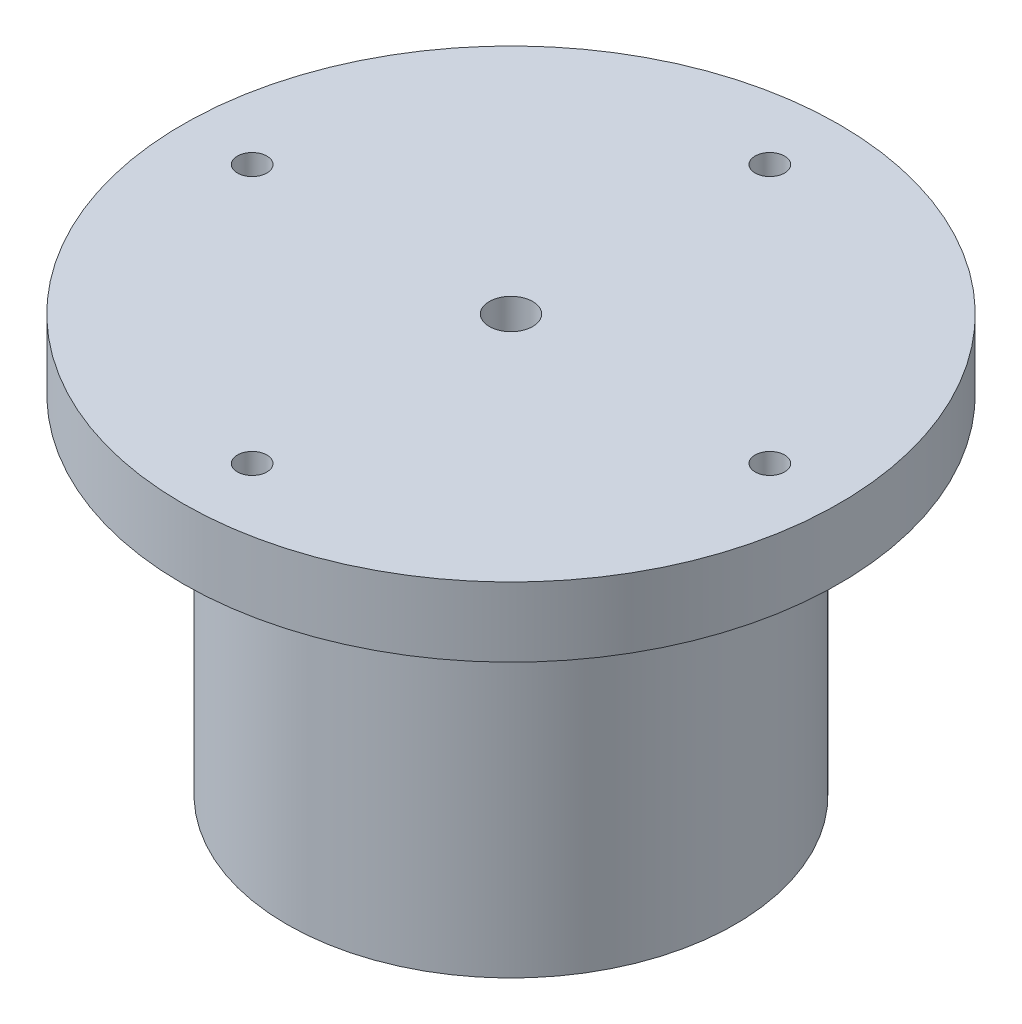
ISO-10303-21;
HEADER;
FILE_DESCRIPTION(('STEP AP214'),'2;1');
FILE_NAME('part.step','',(''),(''),'','','');
FILE_SCHEMA(('AUTOMOTIVE_DESIGN { 1 0 10303 214 1 1 1 1 }'));
ENDSEC;
DATA;
#1=APPLICATION_CONTEXT('core data for automotive mechanical design processes');
#2=APPLICATION_PROTOCOL_DEFINITION('international standard','automotive_design',2000,#1);
#3=PRODUCT_CONTEXT('',#1,'mechanical');
#4=PRODUCT('Part','Part','',(#3));
#5=PRODUCT_RELATED_PRODUCT_CATEGORY('part','',(#4));
#6=PRODUCT_DEFINITION_FORMATION('','',#4);
#7=PRODUCT_DEFINITION_CONTEXT('part definition',#1,'design');
#8=PRODUCT_DEFINITION('design','',#6,#7);
#9=PRODUCT_DEFINITION_SHAPE('','',#8);
#10=(LENGTH_UNIT() NAMED_UNIT(*) SI_UNIT(.MILLI.,.METRE.));
#11=(NAMED_UNIT(*) PLANE_ANGLE_UNIT() SI_UNIT($,.RADIAN.));
#12=(NAMED_UNIT(*) SI_UNIT($,.STERADIAN.) SOLID_ANGLE_UNIT());
#13=UNCERTAINTY_MEASURE_WITH_UNIT(LENGTH_MEASURE(1.E-05),#10,'distance_accuracy_value','');
#14=(GEOMETRIC_REPRESENTATION_CONTEXT(3) GLOBAL_UNCERTAINTY_ASSIGNED_CONTEXT((#13)) GLOBAL_UNIT_ASSIGNED_CONTEXT((#10,
#11,#12)) REPRESENTATION_CONTEXT('',''));
#15=CARTESIAN_POINT('',(0.,0.,0.));
#16=DIRECTION('',(0.,0.,1.));
#17=DIRECTION('',(1.,0.,0.));
#18=AXIS2_PLACEMENT_3D('',#15,#16,#17);
#19=CARTESIAN_POINT('',(-29.825,48.,0.));
#20=DIRECTION('',(0.,-1.,0.));
#21=DIRECTION('',(0.,0.,-1.));
#22=AXIS2_PLACEMENT_3D('',#19,#20,#21);
#23=CYLINDRICAL_SURFACE('',#22,1.7);
#24=CARTESIAN_POINT('',(-29.825,48.,0.));
#25=DIRECTION('',(0.,-1.,0.));
#26=DIRECTION('',(0.,0.,-1.));
#27=AXIS2_PLACEMENT_3D('',#24,#25,#26);
#28=CIRCLE('',#27,1.7);
#29=CARTESIAN_POINT('',(-29.825,48.,-1.7));
#30=VERTEX_POINT('',#29);
#31=EDGE_CURVE('E67',#30,#30,#28,.T.);
#32=ORIENTED_EDGE('',*,*,#31,.F.);
#33=EDGE_LOOP('',(#32));
#34=FACE_BOUND('',#33,.T.);
#35=CARTESIAN_POINT('',(-29.825,44.,0.));
#36=DIRECTION('',(0.,-1.,0.));
#37=DIRECTION('',(0.,0.,-1.));
#38=AXIS2_PLACEMENT_3D('',#35,#36,#37);
#39=CIRCLE('',#38,1.7);
#40=CARTESIAN_POINT('',(-29.825,44.,-1.7));
#41=VERTEX_POINT('',#40);
#42=EDGE_CURVE('E63',#41,#41,#39,.F.);
#43=ORIENTED_EDGE('',*,*,#42,.F.);
#44=EDGE_LOOP('',(#43));
#45=FACE_BOUND('',#44,.T.);
#46=ADVANCED_FACE('F42',(#34,#45),#23,.F.);
#47=CARTESIAN_POINT('',(0.,48.,-29.825));
#48=DIRECTION('',(0.,-1.,0.));
#49=DIRECTION('',(0.,0.,-1.));
#50=AXIS2_PLACEMENT_3D('',#47,#48,#49);
#51=CYLINDRICAL_SURFACE('',#50,1.7);
#52=CARTESIAN_POINT('',(0.,48.,-29.825));
#53=DIRECTION('',(0.,-1.,0.));
#54=DIRECTION('',(0.,0.,-1.));
#55=AXIS2_PLACEMENT_3D('',#52,#53,#54);
#56=CIRCLE('',#55,1.7);
#57=CARTESIAN_POINT('',(0.,48.,-31.525));
#58=VERTEX_POINT('',#57);
#59=EDGE_CURVE('E100',#58,#58,#56,.T.);
#60=ORIENTED_EDGE('',*,*,#59,.F.);
#61=EDGE_LOOP('',(#60));
#62=FACE_BOUND('',#61,.T.);
#63=CARTESIAN_POINT('',(0.,44.,-29.825));
#64=DIRECTION('',(0.,-1.,0.));
#65=DIRECTION('',(0.,0.,-1.));
#66=AXIS2_PLACEMENT_3D('',#63,#64,#65);
#67=CIRCLE('',#66,1.7);
#68=CARTESIAN_POINT('',(0.,44.,-31.525));
#69=VERTEX_POINT('',#68);
#70=EDGE_CURVE('E68',#69,#69,#67,.F.);
#71=ORIENTED_EDGE('',*,*,#70,.F.);
#72=EDGE_LOOP('',(#71));
#73=FACE_BOUND('',#72,.T.);
#74=ADVANCED_FACE('F180',(#62,#73),#51,.F.);
#75=CARTESIAN_POINT('',(29.825,48.,0.));
#76=DIRECTION('',(0.,-1.,0.));
#77=DIRECTION('',(0.,0.,-1.));
#78=AXIS2_PLACEMENT_3D('',#75,#76,#77);
#79=CYLINDRICAL_SURFACE('',#78,1.7);
#80=CARTESIAN_POINT('',(29.825,48.,0.));
#81=DIRECTION('',(0.,-1.,0.));
#82=DIRECTION('',(0.,0.,-1.));
#83=AXIS2_PLACEMENT_3D('',#80,#81,#82);
#84=CIRCLE('',#83,1.7);
#85=CARTESIAN_POINT('',(29.825,48.,-1.7));
#86=VERTEX_POINT('',#85);
#87=EDGE_CURVE('E104',#86,#86,#84,.T.);
#88=ORIENTED_EDGE('',*,*,#87,.F.);
#89=EDGE_LOOP('',(#88));
#90=FACE_BOUND('',#89,.T.);
#91=CARTESIAN_POINT('',(29.825,44.,0.));
#92=DIRECTION('',(0.,-1.,0.));
#93=DIRECTION('',(0.,0.,-1.));
#94=AXIS2_PLACEMENT_3D('',#91,#92,#93);
#95=CIRCLE('',#94,1.7);
#96=CARTESIAN_POINT('',(29.825,44.,-1.7));
#97=VERTEX_POINT('',#96);
#98=EDGE_CURVE('E72',#97,#97,#95,.F.);
#99=ORIENTED_EDGE('',*,*,#98,.F.);
#100=EDGE_LOOP('',(#99));
#101=FACE_BOUND('',#100,.T.);
#102=ADVANCED_FACE('F186',(#90,#101),#79,.F.);
#103=CARTESIAN_POINT('',(0.,48.,29.825));
#104=DIRECTION('',(0.,-1.,0.));
#105=DIRECTION('',(0.,0.,-1.));
#106=AXIS2_PLACEMENT_3D('',#103,#104,#105);
#107=CYLINDRICAL_SURFACE('',#106,1.7);
#108=CARTESIAN_POINT('',(0.,48.,29.825));
#109=DIRECTION('',(0.,-1.,0.));
#110=DIRECTION('',(0.,0.,-1.));
#111=AXIS2_PLACEMENT_3D('',#108,#109,#110);
#112=CIRCLE('',#111,1.7);
#113=CARTESIAN_POINT('',(0.,48.,28.125));
#114=VERTEX_POINT('',#113);
#115=EDGE_CURVE('E93',#114,#114,#112,.T.);
#116=ORIENTED_EDGE('',*,*,#115,.F.);
#117=EDGE_LOOP('',(#116));
#118=FACE_BOUND('',#117,.T.);
#119=CARTESIAN_POINT('',(0.,44.,29.825));
#120=DIRECTION('',(0.,-1.,0.));
#121=DIRECTION('',(0.,0.,-1.));
#122=AXIS2_PLACEMENT_3D('',#119,#120,#121);
#123=CIRCLE('',#122,1.7);
#124=CARTESIAN_POINT('',(0.,44.,28.125));
#125=VERTEX_POINT('',#124);
#126=EDGE_CURVE('E76',#125,#125,#123,.F.);
#127=ORIENTED_EDGE('',*,*,#126,.F.);
#128=EDGE_LOOP('',(#127));
#129=FACE_BOUND('',#128,.T.);
#130=ADVANCED_FACE('F351',(#118,#129),#107,.F.);
#131=CARTESIAN_POINT('',(0.,0.,0.));
#132=DIRECTION('',(0.,1.,0.));
#133=DIRECTION('',(0.,0.,1.));
#134=AXIS2_PLACEMENT_3D('',#131,#132,#133);
#135=PLANE('',#134);
#136=CARTESIAN_POINT('',(0.,0.,0.));
#137=DIRECTION('',(0.,1.,0.));
#138=DIRECTION('',(0.,0.,1.));
#139=AXIS2_PLACEMENT_3D('',#136,#137,#138);
#140=CIRCLE('',#139,19.825);
#141=CARTESIAN_POINT('',(0.,0.,19.825));
#142=VERTEX_POINT('',#141);
#143=EDGE_CURVE('E50',#142,#142,#140,.T.);
#144=ORIENTED_EDGE('',*,*,#143,.T.);
#145=EDGE_LOOP('',(#144));
#146=FACE_BOUND('',#145,.T.);
#147=CARTESIAN_POINT('',(0.,0.,0.));
#148=DIRECTION('',(0.,1.,0.));
#149=DIRECTION('',(0.,0.,1.));
#150=AXIS2_PLACEMENT_3D('',#147,#148,#149);
#151=CIRCLE('',#150,25.825);
#152=CARTESIAN_POINT('',(0.,0.,25.825));
#153=VERTEX_POINT('',#152);
#154=EDGE_CURVE('E60',#153,#153,#151,.T.);
#155=ORIENTED_EDGE('',*,*,#154,.F.);
#156=EDGE_LOOP('',(#155));
#157=FACE_BOUND('',#156,.T.);
#158=ADVANCED_FACE('F175',(#146,#157),#135,.F.);
#159=CARTESIAN_POINT('',(0.,40.,0.));
#160=DIRECTION('',(0.,-1.,0.));
#161=DIRECTION('',(0.,0.,-1.));
#162=AXIS2_PLACEMENT_3D('',#159,#160,#161);
#163=CYLINDRICAL_SURFACE('',#162,25.825);
#164=CARTESIAN_POINT('',(0.,40.,0.));
#165=DIRECTION('',(0.,1.,0.));
#166=DIRECTION('',(0.,0.,1.));
#167=AXIS2_PLACEMENT_3D('',#164,#165,#166);
#168=CIRCLE('',#167,25.825);
#169=CARTESIAN_POINT('',(0.,40.,25.825));
#170=VERTEX_POINT('',#169);
#171=EDGE_CURVE('E55',#170,#170,#168,.T.);
#172=ORIENTED_EDGE('',*,*,#171,.F.);
#173=EDGE_LOOP('',(#172));
#174=FACE_BOUND('',#173,.T.);
#175=ORIENTED_EDGE('',*,*,#154,.T.);
#176=EDGE_LOOP('',(#175));
#177=FACE_BOUND('',#176,.T.);
#178=ADVANCED_FACE('F170',(#174,#177),#163,.T.);
#179=CARTESIAN_POINT('',(0.,40.,0.));
#180=DIRECTION('',(0.,-1.,0.));
#181=DIRECTION('',(0.,0.,-1.));
#182=AXIS2_PLACEMENT_3D('',#179,#180,#181);
#183=CYLINDRICAL_SURFACE('',#182,17.825);
#184=CARTESIAN_POINT('',(0.,2.,0.));
#185=DIRECTION('',(0.,1.,0.));
#186=DIRECTION('',(0.,0.,1.));
#187=AXIS2_PLACEMENT_3D('',#184,#185,#186);
#188=CIRCLE('',#187,17.825);
#189=CARTESIAN_POINT('',(0.,2.,17.825));
#190=VERTEX_POINT('',#189);
#191=EDGE_CURVE('E10',#190,#190,#188,.F.);
#192=ORIENTED_EDGE('',*,*,#191,.T.);
#193=EDGE_LOOP('',(#192));
#194=FACE_BOUND('',#193,.T.);
#195=CARTESIAN_POINT('',(0.,40.,0.));
#196=DIRECTION('',(0.,1.,0.));
#197=DIRECTION('',(0.,0.,1.));
#198=AXIS2_PLACEMENT_3D('',#195,#196,#197);
#199=CIRCLE('',#198,17.825);
#200=CARTESIAN_POINT('',(0.,40.,17.825));
#201=VERTEX_POINT('',#200);
#202=EDGE_CURVE('E83',#201,#201,#199,.T.);
#203=ORIENTED_EDGE('',*,*,#202,.T.);
#204=EDGE_LOOP('',(#203));
#205=FACE_BOUND('',#204,.T.);
#206=ADVANCED_FACE('F164',(#194,#205),#183,.F.);
#207=CARTESIAN_POINT('',(0.,40.,0.));
#208=DIRECTION('',(0.,1.,0.));
#209=DIRECTION('',(0.,0.,1.));
#210=AXIS2_PLACEMENT_3D('',#207,#208,#209);
#211=PLANE('',#210);
#212=CARTESIAN_POINT('',(0.,40.,0.));
#213=DIRECTION('',(0.,-1.,0.));
#214=DIRECTION('',(0.,0.,-1.));
#215=AXIS2_PLACEMENT_3D('',#212,#213,#214);
#216=CIRCLE('',#215,2.5);
#217=CARTESIAN_POINT('',(0.,40.,-2.5));
#218=VERTEX_POINT('',#217);
#219=EDGE_CURVE('E143',#218,#218,#216,.T.);
#220=ORIENTED_EDGE('',*,*,#219,.F.);
#221=EDGE_LOOP('',(#220));
#222=FACE_BOUND('',#221,.T.);
#223=ORIENTED_EDGE('',*,*,#202,.F.);
#224=EDGE_LOOP('',(#223));
#225=FACE_BOUND('',#224,.T.);
#226=ADVANCED_FACE('F160',(#222,#225),#211,.F.);
#227=CARTESIAN_POINT('',(0.,48.,0.));
#228=DIRECTION('',(0.,-1.,0.));
#229=DIRECTION('',(0.,0.,-1.));
#230=AXIS2_PLACEMENT_3D('',#227,#228,#229);
#231=CYLINDRICAL_SURFACE('',#230,37.825);
#232=CARTESIAN_POINT('',(0.,48.,0.));
#233=DIRECTION('',(0.,1.,0.));
#234=DIRECTION('',(0.,0.,1.));
#235=AXIS2_PLACEMENT_3D('',#232,#233,#234);
#236=CIRCLE('',#235,37.825);
#237=CARTESIAN_POINT('',(0.,48.,37.825));
#238=VERTEX_POINT('',#237);
#239=EDGE_CURVE('E88',#238,#238,#236,.T.);
#240=ORIENTED_EDGE('',*,*,#239,.F.);
#241=EDGE_LOOP('',(#240));
#242=FACE_BOUND('',#241,.T.);
#243=CARTESIAN_POINT('',(0.,40.,0.));
#244=DIRECTION('',(0.,1.,0.));
#245=DIRECTION('',(0.,0.,1.));
#246=AXIS2_PLACEMENT_3D('',#243,#244,#245);
#247=CIRCLE('',#246,37.825);
#248=CARTESIAN_POINT('',(0.,40.,37.825));
#249=VERTEX_POINT('',#248);
#250=EDGE_CURVE('E89',#249,#249,#247,.T.);
#251=ORIENTED_EDGE('',*,*,#250,.T.);
#252=EDGE_LOOP('',(#251));
#253=FACE_BOUND('',#252,.T.);
#254=ADVANCED_FACE('F163',(#242,#253),#231,.T.);
#255=CARTESIAN_POINT('',(0.,48.,0.));
#256=DIRECTION('',(0.,1.,0.));
#257=DIRECTION('',(0.,0.,1.));
#258=AXIS2_PLACEMENT_3D('',#255,#256,#257);
#259=PLANE('',#258);
#260=CARTESIAN_POINT('',(0.,48.,0.));
#261=DIRECTION('',(0.,-1.,0.));
#262=DIRECTION('',(0.,0.,-1.));
#263=AXIS2_PLACEMENT_3D('',#260,#261,#262);
#264=CIRCLE('',#263,2.5);
#265=CARTESIAN_POINT('',(0.,48.,-2.5));
#266=VERTEX_POINT('',#265);
#267=EDGE_CURVE('E116',#266,#266,#264,.T.);
#268=ORIENTED_EDGE('',*,*,#267,.T.);
#269=EDGE_LOOP('',(#268));
#270=FACE_BOUND('',#269,.T.);
#271=ORIENTED_EDGE('',*,*,#115,.T.);
#272=EDGE_LOOP('',(#271));
#273=FACE_BOUND('',#272,.T.);
#274=ORIENTED_EDGE('',*,*,#87,.T.);
#275=EDGE_LOOP('',(#274));
#276=FACE_BOUND('',#275,.T.);
#277=ORIENTED_EDGE('',*,*,#59,.T.);
#278=EDGE_LOOP('',(#277));
#279=FACE_BOUND('',#278,.T.);
#280=ORIENTED_EDGE('',*,*,#31,.T.);
#281=EDGE_LOOP('',(#280));
#282=FACE_BOUND('',#281,.T.);
#283=ORIENTED_EDGE('',*,*,#239,.T.);
#284=EDGE_LOOP('',(#283));
#285=FACE_BOUND('',#284,.T.);
#286=ADVANCED_FACE('F151',(#270,#273,#276,#279,#282,#285),#259,.T.);
#287=CARTESIAN_POINT('',(0.,40.,29.825));
#288=DIRECTION('',(0.,-1.,0.));
#289=DIRECTION('',(0.,0.,-1.));
#290=AXIS2_PLACEMENT_3D('',#287,#288,#289);
#291=CIRCLE('',#290,2.85);
#292=CARTESIAN_POINT('',(0.,40.,26.975));
#293=VERTEX_POINT('',#292);
#294=EDGE_CURVE('E136',#293,#293,#291,.T.);
#295=ORIENTED_EDGE('',*,*,#294,.F.);
#296=EDGE_LOOP('',(#295));
#297=FACE_BOUND('',#296,.T.);
#298=CARTESIAN_POINT('',(29.825,40.,0.));
#299=DIRECTION('',(0.,-1.,0.));
#300=DIRECTION('',(0.,0.,-1.));
#301=AXIS2_PLACEMENT_3D('',#298,#299,#300);
#302=CIRCLE('',#301,2.85);
#303=CARTESIAN_POINT('',(29.825,40.,-2.84999999999999));
#304=VERTEX_POINT('',#303);
#305=EDGE_CURVE('E132',#304,#304,#302,.T.);
#306=ORIENTED_EDGE('',*,*,#305,.F.);
#307=EDGE_LOOP('',(#306));
#308=FACE_BOUND('',#307,.T.);
#309=CARTESIAN_POINT('',(0.,40.,-29.825));
#310=DIRECTION('',(0.,-1.,0.));
#311=DIRECTION('',(0.,0.,-1.));
#312=AXIS2_PLACEMENT_3D('',#309,#310,#311);
#313=CIRCLE('',#312,2.85);
#314=CARTESIAN_POINT('',(0.,40.,-32.675));
#315=VERTEX_POINT('',#314);
#316=EDGE_CURVE('E124',#315,#315,#313,.T.);
#317=ORIENTED_EDGE('',*,*,#316,.F.);
#318=EDGE_LOOP('',(#317));
#319=FACE_BOUND('',#318,.T.);
#320=CARTESIAN_POINT('',(-29.825,40.,0.));
#321=DIRECTION('',(0.,-1.,0.));
#322=DIRECTION('',(0.,0.,-1.));
#323=AXIS2_PLACEMENT_3D('',#320,#321,#322);
#324=CIRCLE('',#323,2.85);
#325=CARTESIAN_POINT('',(-29.825,40.,-2.85));
#326=VERTEX_POINT('',#325);
#327=EDGE_CURVE('E115',#326,#326,#324,.T.);
#328=ORIENTED_EDGE('',*,*,#327,.F.);
#329=EDGE_LOOP('',(#328));
#330=FACE_BOUND('',#329,.T.);
#331=ORIENTED_EDGE('',*,*,#171,.T.);
#332=EDGE_LOOP('',(#331));
#333=FACE_BOUND('',#332,.T.);
#334=ORIENTED_EDGE('',*,*,#250,.F.);
#335=EDGE_LOOP('',(#334));
#336=FACE_BOUND('',#335,.T.);
#337=ADVANCED_FACE('F166',(#297,#308,#319,#330,#333,#336),#211,.F.);
#338=CARTESIAN_POINT('',(0.,44.,29.825));
#339=DIRECTION('',(0.,-1.,0.));
#340=DIRECTION('',(0.,0.,-1.));
#341=AXIS2_PLACEMENT_3D('',#338,#339,#340);
#342=PLANE('',#341);
#343=CARTESIAN_POINT('',(0.,44.,29.825));
#344=DIRECTION('',(0.,-1.,0.));
#345=DIRECTION('',(0.,0.,-1.));
#346=AXIS2_PLACEMENT_3D('',#343,#344,#345);
#347=CIRCLE('',#346,2.85);
#348=CARTESIAN_POINT('',(0.,44.,26.975));
#349=VERTEX_POINT('',#348);
#350=EDGE_CURVE('E80',#349,#349,#347,.T.);
#351=ORIENTED_EDGE('',*,*,#350,.T.);
#352=EDGE_LOOP('',(#351));
#353=FACE_BOUND('',#352,.T.);
#354=ORIENTED_EDGE('',*,*,#126,.T.);
#355=EDGE_LOOP('',(#354));
#356=FACE_BOUND('',#355,.T.);
#357=ADVANCED_FACE('F195',(#353,#356),#342,.T.);
#358=CARTESIAN_POINT('',(0.,44.,29.825));
#359=DIRECTION('',(0.,-1.,0.));
#360=DIRECTION('',(0.,0.,-1.));
#361=AXIS2_PLACEMENT_3D('',#358,#359,#360);
#362=CYLINDRICAL_SURFACE('',#361,2.85);
#363=ORIENTED_EDGE('',*,*,#350,.F.);
#364=EDGE_LOOP('',(#363));
#365=FACE_BOUND('',#364,.T.);
#366=ORIENTED_EDGE('',*,*,#294,.T.);
#367=EDGE_LOOP('',(#366));
#368=FACE_BOUND('',#367,.T.);
#369=ADVANCED_FACE('F225',(#365,#368),#362,.F.);
#370=CARTESIAN_POINT('',(29.825,44.,0.));
#371=DIRECTION('',(0.,-1.,0.));
#372=DIRECTION('',(0.,0.,-1.));
#373=AXIS2_PLACEMENT_3D('',#370,#371,#372);
#374=PLANE('',#373);
#375=CARTESIAN_POINT('',(29.825,44.,0.));
#376=DIRECTION('',(0.,-1.,0.));
#377=DIRECTION('',(0.,0.,-1.));
#378=AXIS2_PLACEMENT_3D('',#375,#376,#377);
#379=CIRCLE('',#378,2.85);
#380=CARTESIAN_POINT('',(29.825,44.,-2.84999999999999));
#381=VERTEX_POINT('',#380);
#382=EDGE_CURVE('E128',#381,#381,#379,.T.);
#383=ORIENTED_EDGE('',*,*,#382,.T.);
#384=EDGE_LOOP('',(#383));
#385=FACE_BOUND('',#384,.T.);
#386=ORIENTED_EDGE('',*,*,#98,.T.);
#387=EDGE_LOOP('',(#386));
#388=FACE_BOUND('',#387,.T.);
#389=ADVANCED_FACE('F233',(#385,#388),#374,.T.);
#390=CARTESIAN_POINT('',(29.825,44.,0.));
#391=DIRECTION('',(0.,-1.,0.));
#392=DIRECTION('',(0.,0.,-1.));
#393=AXIS2_PLACEMENT_3D('',#390,#391,#392);
#394=CYLINDRICAL_SURFACE('',#393,2.85);
#395=ORIENTED_EDGE('',*,*,#382,.F.);
#396=EDGE_LOOP('',(#395));
#397=FACE_BOUND('',#396,.T.);
#398=ORIENTED_EDGE('',*,*,#305,.T.);
#399=EDGE_LOOP('',(#398));
#400=FACE_BOUND('',#399,.T.);
#401=ADVANCED_FACE('F241',(#397,#400),#394,.F.);
#402=CARTESIAN_POINT('',(0.,44.,-29.825));
#403=DIRECTION('',(0.,-1.,0.));
#404=DIRECTION('',(0.,0.,-1.));
#405=AXIS2_PLACEMENT_3D('',#402,#403,#404);
#406=PLANE('',#405);
#407=CARTESIAN_POINT('',(0.,44.,-29.825));
#408=DIRECTION('',(0.,-1.,0.));
#409=DIRECTION('',(0.,0.,-1.));
#410=AXIS2_PLACEMENT_3D('',#407,#408,#409);
#411=CIRCLE('',#410,2.85);
#412=CARTESIAN_POINT('',(0.,44.,-32.675));
#413=VERTEX_POINT('',#412);
#414=EDGE_CURVE('E120',#413,#413,#411,.T.);
#415=ORIENTED_EDGE('',*,*,#414,.T.);
#416=EDGE_LOOP('',(#415));
#417=FACE_BOUND('',#416,.T.);
#418=ORIENTED_EDGE('',*,*,#70,.T.);
#419=EDGE_LOOP('',(#418));
#420=FACE_BOUND('',#419,.T.);
#421=ADVANCED_FACE('F249',(#417,#420),#406,.T.);
#422=CARTESIAN_POINT('',(0.,44.,-29.825));
#423=DIRECTION('',(0.,-1.,0.));
#424=DIRECTION('',(0.,0.,-1.));
#425=AXIS2_PLACEMENT_3D('',#422,#423,#424);
#426=CYLINDRICAL_SURFACE('',#425,2.85);
#427=ORIENTED_EDGE('',*,*,#414,.F.);
#428=EDGE_LOOP('',(#427));
#429=FACE_BOUND('',#428,.T.);
#430=ORIENTED_EDGE('',*,*,#316,.T.);
#431=EDGE_LOOP('',(#430));
#432=FACE_BOUND('',#431,.T.);
#433=ADVANCED_FACE('F257',(#429,#432),#426,.F.);
#434=CARTESIAN_POINT('',(-29.825,44.,0.));
#435=DIRECTION('',(0.,-1.,0.));
#436=DIRECTION('',(0.,0.,-1.));
#437=AXIS2_PLACEMENT_3D('',#434,#435,#436);
#438=PLANE('',#437);
#439=CARTESIAN_POINT('',(-29.825,44.,0.));
#440=DIRECTION('',(0.,-1.,0.));
#441=DIRECTION('',(0.,0.,-1.));
#442=AXIS2_PLACEMENT_3D('',#439,#440,#441);
#443=CIRCLE('',#442,2.85);
#444=CARTESIAN_POINT('',(-29.825,44.,-2.85));
#445=VERTEX_POINT('',#444);
#446=EDGE_CURVE('E111',#445,#445,#443,.T.);
#447=ORIENTED_EDGE('',*,*,#446,.T.);
#448=EDGE_LOOP('',(#447));
#449=FACE_BOUND('',#448,.T.);
#450=ORIENTED_EDGE('',*,*,#42,.T.);
#451=EDGE_LOOP('',(#450));
#452=FACE_BOUND('',#451,.T.);
#453=ADVANCED_FACE('F265',(#449,#452),#438,.T.);
#454=CARTESIAN_POINT('',(-29.825,44.,0.));
#455=DIRECTION('',(0.,-1.,0.));
#456=DIRECTION('',(0.,0.,-1.));
#457=AXIS2_PLACEMENT_3D('',#454,#455,#456);
#458=CYLINDRICAL_SURFACE('',#457,2.85);
#459=ORIENTED_EDGE('',*,*,#446,.F.);
#460=EDGE_LOOP('',(#459));
#461=FACE_BOUND('',#460,.T.);
#462=ORIENTED_EDGE('',*,*,#327,.T.);
#463=EDGE_LOOP('',(#462));
#464=FACE_BOUND('',#463,.T.);
#465=ADVANCED_FACE('F273',(#461,#464),#458,.F.);
#466=CARTESIAN_POINT('',(0.,2.,0.));
#467=DIRECTION('',(0.,1.,0.));
#468=DIRECTION('',(0.,0.,1.));
#469=AXIS2_PLACEMENT_3D('',#466,#467,#468);
#470=TOROIDAL_SURFACE('',#469,19.825,2.);
#471=ORIENTED_EDGE('',*,*,#191,.F.);
#472=EDGE_LOOP('',(#471));
#473=FACE_BOUND('',#472,.T.);
#474=ORIENTED_EDGE('',*,*,#143,.F.);
#475=EDGE_LOOP('',(#474));
#476=FACE_BOUND('',#475,.T.);
#477=ADVANCED_FACE('F44',(#473,#476),#470,.T.);
#478=CARTESIAN_POINT('',(0.,48.,0.));
#479=DIRECTION('',(0.,-1.,0.));
#480=DIRECTION('',(0.,0.,-1.));
#481=AXIS2_PLACEMENT_3D('',#478,#479,#480);
#482=CYLINDRICAL_SURFACE('',#481,2.5);
#483=ORIENTED_EDGE('',*,*,#267,.F.);
#484=EDGE_LOOP('',(#483));
#485=FACE_BOUND('',#484,.T.);
#486=ORIENTED_EDGE('',*,*,#219,.T.);
#487=EDGE_LOOP('',(#486));
#488=FACE_BOUND('',#487,.T.);
#489=ADVANCED_FACE('F154',(#485,#488),#482,.F.);
#490=CLOSED_SHELL('',(#46,#74,#102,#130,#158,#178,#206,#226,#254,#286,#337,#357,#369,#389,#401,
#421,#433,#453,#465,#477,#489));
#491=MANIFOLD_SOLID_BREP('B2',#490);
#492=ADVANCED_BREP_SHAPE_REPRESENTATION('',(#18,#491),#14);
#493=SHAPE_DEFINITION_REPRESENTATION(#9,#492);
ENDSEC;
END-ISO-10303-21;
